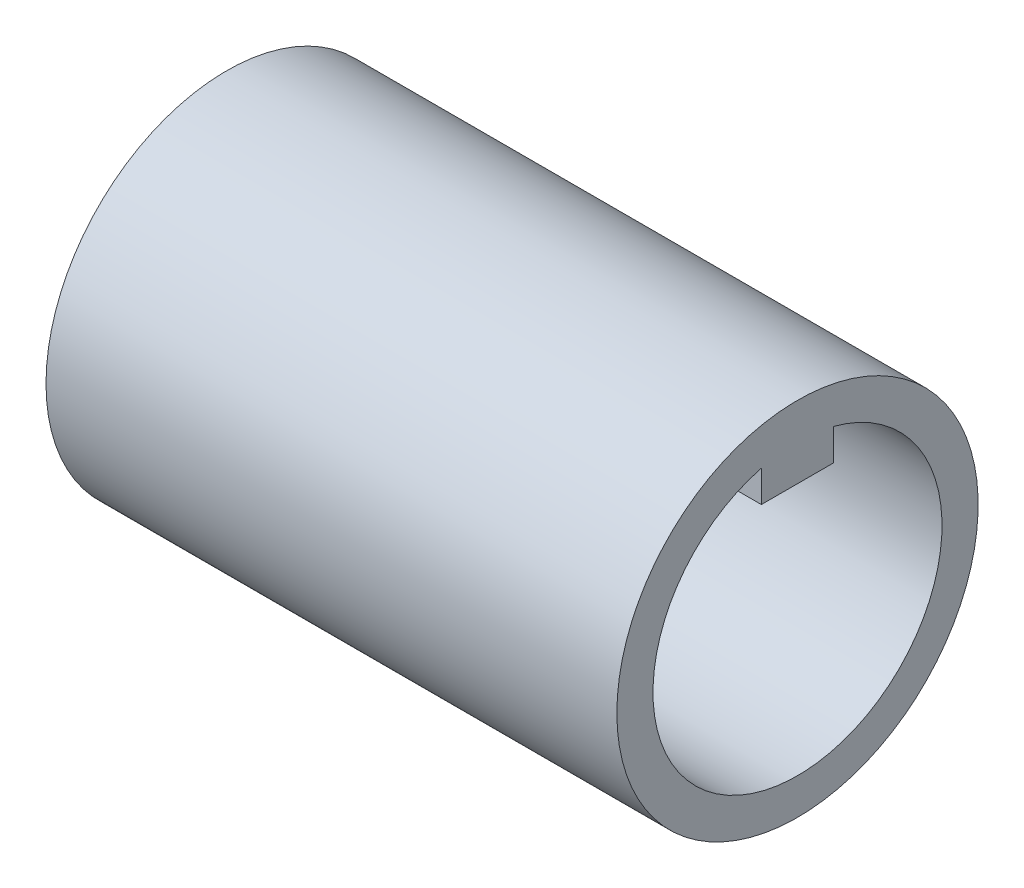
ISO-10303-21;
HEADER;
FILE_DESCRIPTION(('STEP AP214'),'2;1');
FILE_NAME('part.step','',(''),(''),'','','');
FILE_SCHEMA(('AUTOMOTIVE_DESIGN { 1 0 10303 214 1 1 1 1 }'));
ENDSEC;
DATA;
#1=APPLICATION_CONTEXT('core data for automotive mechanical design processes');
#2=APPLICATION_PROTOCOL_DEFINITION('international standard','automotive_design',2000,#1);
#3=PRODUCT_CONTEXT('',#1,'mechanical');
#4=PRODUCT('Part','Part','',(#3));
#5=PRODUCT_RELATED_PRODUCT_CATEGORY('part','',(#4));
#6=PRODUCT_DEFINITION_FORMATION('','',#4);
#7=PRODUCT_DEFINITION_CONTEXT('part definition',#1,'design');
#8=PRODUCT_DEFINITION('design','',#6,#7);
#9=PRODUCT_DEFINITION_SHAPE('','',#8);
#10=(LENGTH_UNIT() NAMED_UNIT(*) SI_UNIT(.MILLI.,.METRE.));
#11=(NAMED_UNIT(*) PLANE_ANGLE_UNIT() SI_UNIT($,.RADIAN.));
#12=(NAMED_UNIT(*) SI_UNIT($,.STERADIAN.) SOLID_ANGLE_UNIT());
#13=UNCERTAINTY_MEASURE_WITH_UNIT(LENGTH_MEASURE(1.E-05),#10,'distance_accuracy_value','');
#14=(GEOMETRIC_REPRESENTATION_CONTEXT(3) GLOBAL_UNCERTAINTY_ASSIGNED_CONTEXT((#13)) GLOBAL_UNIT_ASSIGNED_CONTEXT((#10,
#11,#12)) REPRESENTATION_CONTEXT('',''));
#15=CARTESIAN_POINT('',(0.,0.,0.));
#16=DIRECTION('',(0.,0.,1.));
#17=DIRECTION('',(1.,0.,0.));
#18=AXIS2_PLACEMENT_3D('',#15,#16,#17);
#19=CARTESIAN_POINT('',(-1000.,0.,0.));
#20=DIRECTION('',(-1.,0.,0.));
#21=DIRECTION('',(0.,0.,1.));
#22=AXIS2_PLACEMENT_3D('',#19,#20,#21);
#23=CYLINDRICAL_SURFACE('',#22,10.0000000000004);
#24=CARTESIAN_POINT('',(0.,0.,0.));
#25=DIRECTION('',(-1.,0.,0.));
#26=DIRECTION('',(0.,0.,1.));
#27=AXIS2_PLACEMENT_3D('',#24,#25,#26);
#28=CIRCLE('',#27,10.0000000000004);
#29=CARTESIAN_POINT('',(0.,9.68245836551891,-2.50000000000034));
#30=VERTEX_POINT('',#29);
#31=CARTESIAN_POINT('',(0.,9.68245836551909,2.49999999999966));
#32=VERTEX_POINT('',#31);
#33=EDGE_CURVE('E11',#30,#32,#28,.T.);
#34=ORIENTED_EDGE('',*,*,#33,.F.);
#35=DIRECTION('',(-1.,0.,0.));
#36=VECTOR('',#35,1.);
#37=CARTESIAN_POINT('',(-1000.,9.68245836551891,-2.50000000000033));
#38=LINE('',#37,#36);
#39=CARTESIAN_POINT('',(-35.5,9.68245836551891,-2.50000000000034));
#40=VERTEX_POINT('',#39);
#41=EDGE_CURVE('E105',#30,#40,#38,.T.);
#42=ORIENTED_EDGE('',*,*,#41,.T.);
#43=CARTESIAN_POINT('',(-35.5,0.,0.));
#44=DIRECTION('',(-1.,0.,0.));
#45=DIRECTION('',(0.,0.,1.));
#46=AXIS2_PLACEMENT_3D('',#43,#44,#45);
#47=CIRCLE('',#46,10.0000000000004);
#48=CARTESIAN_POINT('',(-35.5,9.68245836551908,2.49999999999967));
#49=VERTEX_POINT('',#48);
#50=EDGE_CURVE('E44',#40,#49,#47,.T.);
#51=ORIENTED_EDGE('',*,*,#50,.T.);
#52=DIRECTION('',(-1.,0.,0.));
#53=VECTOR('',#52,1.);
#54=CARTESIAN_POINT('',(-1000.,9.68245836551909,2.49999999999966));
#55=LINE('',#54,#53);
#56=EDGE_CURVE('E102',#49,#32,#55,.F.);
#57=ORIENTED_EDGE('',*,*,#56,.T.);
#58=EDGE_LOOP('',(#34,#42,#51,#57));
#59=FACE_BOUND('',#58,.T.);
#60=ADVANCED_FACE('F36',(#59),#23,.F.);
#61=CARTESIAN_POINT('',(0.,0.,-12.5));
#62=DIRECTION('',(-1.,0.,0.));
#63=DIRECTION('',(0.,0.,1.));
#64=AXIS2_PLACEMENT_3D('',#61,#62,#63);
#65=PLANE('',#64);
#66=DIRECTION('',(0.,1.,0.));
#67=VECTOR('',#66,1.);
#68=CARTESIAN_POINT('',(0.,7.50000000000043,-2.50000000000034));
#69=LINE('',#68,#67);
#70=CARTESIAN_POINT('',(0.,7.50000000000043,-2.50000000000034));
#71=VERTEX_POINT('',#70);
#72=EDGE_CURVE('E85',#71,#30,#69,.T.);
#73=ORIENTED_EDGE('',*,*,#72,.T.);
#74=ORIENTED_EDGE('',*,*,#33,.T.);
#75=DIRECTION('',(0.,-1.,0.));
#76=VECTOR('',#75,1.);
#77=CARTESIAN_POINT('',(0.,7.50000000000043,2.49999999999966));
#78=LINE('',#77,#76);
#79=CARTESIAN_POINT('',(0.,7.50000000000043,2.49999999999966));
#80=VERTEX_POINT('',#79);
#81=EDGE_CURVE('E77',#32,#80,#78,.T.);
#82=ORIENTED_EDGE('',*,*,#81,.T.);
#83=DIRECTION('',(0.,0.,-1.));
#84=VECTOR('',#83,1.);
#85=CARTESIAN_POINT('',(0.,7.50000000000043,-2.50000000000034));
#86=LINE('',#85,#84);
#87=EDGE_CURVE('E80',#80,#71,#86,.T.);
#88=ORIENTED_EDGE('',*,*,#87,.T.);
#89=EDGE_LOOP('',(#73,#74,#82,#88));
#90=FACE_BOUND('',#89,.T.);
#91=CARTESIAN_POINT('',(0.,0.,0.));
#92=DIRECTION('',(-1.,0.,0.));
#93=DIRECTION('',(0.,0.,1.));
#94=AXIS2_PLACEMENT_3D('',#91,#92,#93);
#95=CIRCLE('',#94,12.5);
#96=CARTESIAN_POINT('',(0.,0.,12.5));
#97=VERTEX_POINT('',#96);
#98=EDGE_CURVE('E107',#97,#97,#95,.T.);
#99=ORIENTED_EDGE('',*,*,#98,.F.);
#100=EDGE_LOOP('',(#99));
#101=FACE_BOUND('',#100,.T.);
#102=ADVANCED_FACE('F38',(#90,#101),#65,.F.);
#103=CARTESIAN_POINT('',(-35.5,0.,-10.0000000000004));
#104=DIRECTION('',(-1.,0.,0.));
#105=DIRECTION('',(0.,0.,1.));
#106=AXIS2_PLACEMENT_3D('',#103,#104,#105);
#107=PLANE('',#106);
#108=ORIENTED_EDGE('',*,*,#50,.F.);
#109=DIRECTION('',(0.,-1.,0.));
#110=VECTOR('',#109,1.);
#111=CARTESIAN_POINT('',(-35.5,0.,-2.50000000000034));
#112=LINE('',#111,#110);
#113=CARTESIAN_POINT('',(-35.5,7.50000000000043,-2.50000000000034));
#114=VERTEX_POINT('',#113);
#115=EDGE_CURVE('E59',#40,#114,#112,.T.);
#116=ORIENTED_EDGE('',*,*,#115,.T.);
#117=DIRECTION('',(0.,0.,1.));
#118=VECTOR('',#117,1.);
#119=CARTESIAN_POINT('',(-35.5,7.50000000000043,-10.0000000000004));
#120=LINE('',#119,#118);
#121=CARTESIAN_POINT('',(-35.5,7.50000000000043,2.49999999999967));
#122=VERTEX_POINT('',#121);
#123=EDGE_CURVE('E95',#114,#122,#120,.T.);
#124=ORIENTED_EDGE('',*,*,#123,.T.);
#125=DIRECTION('',(0.,1.,0.));
#126=VECTOR('',#125,1.);
#127=CARTESIAN_POINT('',(-35.5,0.,2.49999999999967));
#128=LINE('',#127,#126);
#129=EDGE_CURVE('E89',#122,#49,#128,.T.);
#130=ORIENTED_EDGE('',*,*,#129,.T.);
#131=EDGE_LOOP('',(#108,#116,#124,#130));
#132=FACE_BOUND('',#131,.T.);
#133=CARTESIAN_POINT('',(-35.5,0.,0.));
#134=DIRECTION('',(-1.,0.,0.));
#135=DIRECTION('',(0.,0.,1.));
#136=AXIS2_PLACEMENT_3D('',#133,#134,#135);
#137=CIRCLE('',#136,4.25);
#138=CARTESIAN_POINT('',(-35.5,0.,4.25));
#139=VERTEX_POINT('',#138);
#140=EDGE_CURVE('E116',#139,#139,#137,.T.);
#141=ORIENTED_EDGE('',*,*,#140,.T.);
#142=EDGE_LOOP('',(#141));
#143=FACE_BOUND('',#142,.T.);
#144=ADVANCED_FACE('F122',(#132,#143),#107,.F.);
#145=CARTESIAN_POINT('',(-1000.,0.,0.));
#146=DIRECTION('',(-1.,0.,0.));
#147=DIRECTION('',(0.,0.,1.));
#148=AXIS2_PLACEMENT_3D('',#145,#146,#147);
#149=CYLINDRICAL_SURFACE('',#148,4.25);
#150=ORIENTED_EDGE('',*,*,#140,.F.);
#151=EDGE_LOOP('',(#150));
#152=FACE_BOUND('',#151,.T.);
#153=CARTESIAN_POINT('',(-39.5,0.,0.));
#154=DIRECTION('',(-1.,0.,0.));
#155=DIRECTION('',(0.,0.,1.));
#156=AXIS2_PLACEMENT_3D('',#153,#154,#155);
#157=CIRCLE('',#156,4.25);
#158=CARTESIAN_POINT('',(-39.5,0.,4.25));
#159=VERTEX_POINT('',#158);
#160=EDGE_CURVE('E113',#159,#159,#157,.T.);
#161=ORIENTED_EDGE('',*,*,#160,.T.);
#162=EDGE_LOOP('',(#161));
#163=FACE_BOUND('',#162,.T.);
#164=ADVANCED_FACE('F144',(#152,#163),#149,.F.);
#165=CARTESIAN_POINT('',(-39.5,0.,-4.25));
#166=DIRECTION('',(1.,0.,0.));
#167=DIRECTION('',(0.,0.,-1.));
#168=AXIS2_PLACEMENT_3D('',#165,#166,#167);
#169=PLANE('',#168);
#170=ORIENTED_EDGE('',*,*,#160,.F.);
#171=EDGE_LOOP('',(#170));
#172=FACE_BOUND('',#171,.T.);
#173=CARTESIAN_POINT('',(-39.5,0.,0.));
#174=DIRECTION('',(-1.,0.,0.));
#175=DIRECTION('',(0.,0.,1.));
#176=AXIS2_PLACEMENT_3D('',#173,#174,#175);
#177=CIRCLE('',#176,12.5);
#178=CARTESIAN_POINT('',(-39.5,0.,12.5));
#179=VERTEX_POINT('',#178);
#180=EDGE_CURVE('E110',#179,#179,#177,.T.);
#181=ORIENTED_EDGE('',*,*,#180,.T.);
#182=EDGE_LOOP('',(#181));
#183=FACE_BOUND('',#182,.T.);
#184=ADVANCED_FACE('F133',(#172,#183),#169,.F.);
#185=CARTESIAN_POINT('',(-1000.,0.,0.));
#186=DIRECTION('',(-1.,0.,0.));
#187=DIRECTION('',(0.,0.,1.));
#188=AXIS2_PLACEMENT_3D('',#185,#186,#187);
#189=CYLINDRICAL_SURFACE('',#188,12.5);
#190=ORIENTED_EDGE('',*,*,#180,.F.);
#191=EDGE_LOOP('',(#190));
#192=FACE_BOUND('',#191,.T.);
#193=ORIENTED_EDGE('',*,*,#98,.T.);
#194=EDGE_LOOP('',(#193));
#195=FACE_BOUND('',#194,.T.);
#196=ADVANCED_FACE('F126',(#192,#195),#189,.T.);
#197=CARTESIAN_POINT('',(5.59016994374956,7.50000000000043,-2.50000000000034));
#198=DIRECTION('',(0.,0.,-1.));
#199=DIRECTION('',(-1.,0.,0.));
#200=AXIS2_PLACEMENT_3D('',#197,#198,#199);
#201=PLANE('',#200);
#202=ORIENTED_EDGE('',*,*,#41,.F.);
#203=ORIENTED_EDGE('',*,*,#72,.F.);
#204=DIRECTION('',(-1.,0.,0.));
#205=VECTOR('',#204,1.);
#206=CARTESIAN_POINT('',(5.59016994374956,7.50000000000043,-2.50000000000034));
#207=LINE('',#206,#205);
#208=EDGE_CURVE('E91',#71,#114,#207,.T.);
#209=ORIENTED_EDGE('',*,*,#208,.T.);
#210=ORIENTED_EDGE('',*,*,#115,.F.);
#211=EDGE_LOOP('',(#202,#203,#209,#210));
#212=FACE_BOUND('',#211,.T.);
#213=ADVANCED_FACE('F124',(#212),#201,.T.);
#214=CARTESIAN_POINT('',(5.59016994374956,7.50000000000043,2.49999999999966));
#215=DIRECTION('',(0.,0.,1.));
#216=DIRECTION('',(1.,0.,0.));
#217=AXIS2_PLACEMENT_3D('',#214,#215,#216);
#218=PLANE('',#217);
#219=ORIENTED_EDGE('',*,*,#56,.F.);
#220=ORIENTED_EDGE('',*,*,#129,.F.);
#221=DIRECTION('',(-1.,0.,0.));
#222=VECTOR('',#221,1.);
#223=CARTESIAN_POINT('',(5.59016994374956,7.50000000000043,2.49999999999966));
#224=LINE('',#223,#222);
#225=EDGE_CURVE('E51',#80,#122,#224,.T.);
#226=ORIENTED_EDGE('',*,*,#225,.F.);
#227=ORIENTED_EDGE('',*,*,#81,.F.);
#228=EDGE_LOOP('',(#219,#220,#226,#227));
#229=FACE_BOUND('',#228,.T.);
#230=ADVANCED_FACE('F87',(#229),#218,.T.);
#231=CARTESIAN_POINT('',(5.59016994374956,7.50000000000043,-2.50000000000034));
#232=DIRECTION('',(0.,-1.,0.));
#233=DIRECTION('',(0.,0.,-1.));
#234=AXIS2_PLACEMENT_3D('',#231,#232,#233);
#235=PLANE('',#234);
#236=ORIENTED_EDGE('',*,*,#123,.F.);
#237=ORIENTED_EDGE('',*,*,#208,.F.);
#238=ORIENTED_EDGE('',*,*,#87,.F.);
#239=ORIENTED_EDGE('',*,*,#225,.T.);
#240=EDGE_LOOP('',(#236,#237,#238,#239));
#241=FACE_BOUND('',#240,.T.);
#242=ADVANCED_FACE('F94',(#241),#235,.T.);
#243=CLOSED_SHELL('',(#60,#102,#144,#164,#184,#196,#213,#230,#242));
#244=MANIFOLD_SOLID_BREP('B2',#243);
#245=ADVANCED_BREP_SHAPE_REPRESENTATION('',(#18,#244),#14);
#246=SHAPE_DEFINITION_REPRESENTATION(#9,#245);
ENDSEC;
END-ISO-10303-21;
